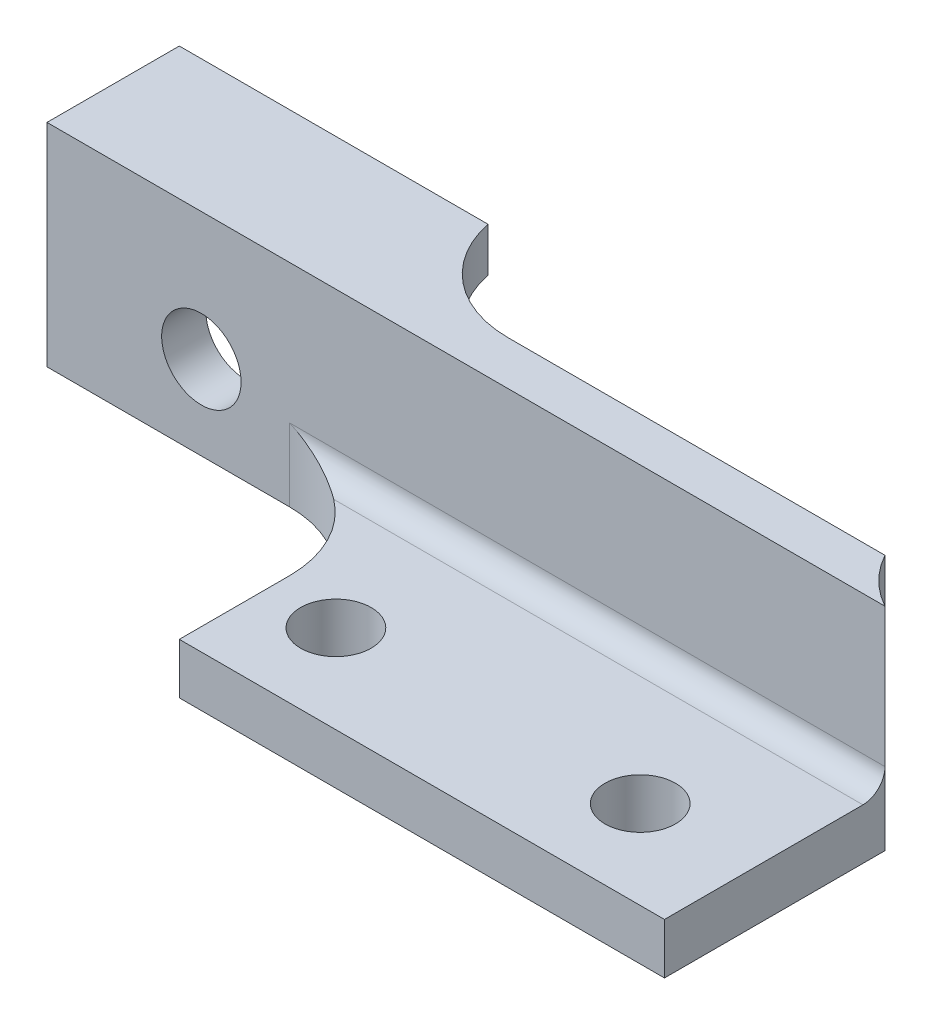
ISO-10303-21;
HEADER;
FILE_DESCRIPTION(('STEP AP214'),'2;1');
FILE_NAME('part.step','',(''),(''),'','','');
FILE_SCHEMA(('AUTOMOTIVE_DESIGN { 1 0 10303 214 1 1 1 1 }'));
ENDSEC;
DATA;
#1=APPLICATION_CONTEXT('core data for automotive mechanical design processes');
#2=APPLICATION_PROTOCOL_DEFINITION('international standard','automotive_design',2000,#1);
#3=PRODUCT_CONTEXT('',#1,'mechanical');
#4=PRODUCT('Part','Part','',(#3));
#5=PRODUCT_RELATED_PRODUCT_CATEGORY('part','',(#4));
#6=PRODUCT_DEFINITION_FORMATION('','',#4);
#7=PRODUCT_DEFINITION_CONTEXT('part definition',#1,'design');
#8=PRODUCT_DEFINITION('design','',#6,#7);
#9=PRODUCT_DEFINITION_SHAPE('','',#8);
#10=(LENGTH_UNIT() NAMED_UNIT(*) SI_UNIT(.MILLI.,.METRE.));
#11=(NAMED_UNIT(*) PLANE_ANGLE_UNIT() SI_UNIT($,.RADIAN.));
#12=(NAMED_UNIT(*) SI_UNIT($,.STERADIAN.) SOLID_ANGLE_UNIT());
#13=UNCERTAINTY_MEASURE_WITH_UNIT(LENGTH_MEASURE(1.E-05),#10,'distance_accuracy_value','');
#14=(GEOMETRIC_REPRESENTATION_CONTEXT(3) GLOBAL_UNCERTAINTY_ASSIGNED_CONTEXT((#13)) GLOBAL_UNIT_ASSIGNED_CONTEXT((#10,
#11,#12)) REPRESENTATION_CONTEXT('',''));
#15=CARTESIAN_POINT('',(0.,0.,0.));
#16=DIRECTION('',(0.,0.,1.));
#17=DIRECTION('',(1.,0.,0.));
#18=AXIS2_PLACEMENT_3D('',#15,#16,#17);
#19=CARTESIAN_POINT('',(-14.,0.,0.));
#20=DIRECTION('',(0.,0.,-1.));
#21=DIRECTION('',(-1.,0.,0.));
#22=AXIS2_PLACEMENT_3D('',#19,#20,#21);
#23=PLANE('',#22);
#24=CARTESIAN_POINT('',(-7.,0.,0.));
#25=DIRECTION('',(0.,0.,-1.));
#26=DIRECTION('',(-1.,0.,0.));
#27=AXIS2_PLACEMENT_3D('',#24,#25,#26);
#28=CIRCLE('',#27,1.8);
#29=CARTESIAN_POINT('',(-5.2,0.,0.));
#30=VERTEX_POINT('',#29);
#31=EDGE_CURVE('E156',#30,#30,#28,.F.);
#32=ORIENTED_EDGE('',*,*,#31,.T.);
#33=EDGE_LOOP('',(#32));
#34=FACE_BOUND('',#33,.T.);
#35=DIRECTION('',(1.,0.,0.));
#36=VECTOR('',#35,1.);
#37=CARTESIAN_POINT('',(-14.,3.8,0.));
#38=LINE('',#37,#36);
#39=CARTESIAN_POINT('',(-14.,3.8,0.));
#40=VERTEX_POINT('',#39);
#41=CARTESIAN_POINT('',(4.89897948556636,3.8,0.));
#42=VERTEX_POINT('',#41);
#43=EDGE_CURVE('E188',#40,#42,#38,.T.);
#44=ORIENTED_EDGE('',*,*,#43,.T.);
#45=DIRECTION('',(0.,-1.,0.));
#46=VECTOR('',#45,1.);
#47=CARTESIAN_POINT('',(4.89897948556636,5.8,0.));
#48=LINE('',#47,#46);
#49=CARTESIAN_POINT('',(4.89897948556636,5.8,0.));
#50=VERTEX_POINT('',#49);
#51=EDGE_CURVE('E193',#42,#50,#48,.F.);
#52=ORIENTED_EDGE('',*,*,#51,.T.);
#53=DIRECTION('',(-1.,0.,0.));
#54=VECTOR('',#53,1.);
#55=CARTESIAN_POINT('',(22.,5.8,0.));
#56=LINE('',#55,#54);
#57=CARTESIAN_POINT('',(22.,5.8,0.));
#58=VERTEX_POINT('',#57);
#59=EDGE_CURVE('E166',#58,#50,#56,.T.);
#60=ORIENTED_EDGE('',*,*,#59,.F.);
#61=DIRECTION('',(0.,1.,0.));
#62=VECTOR('',#61,1.);
#63=CARTESIAN_POINT('',(22.,0.,0.));
#64=LINE('',#63,#62);
#65=CARTESIAN_POINT('',(22.,-3.8,0.));
#66=VERTEX_POINT('',#65);
#67=EDGE_CURVE('E164',#66,#58,#64,.T.);
#68=ORIENTED_EDGE('',*,*,#67,.F.);
#69=DIRECTION('',(1.,0.,0.));
#70=VECTOR('',#69,1.);
#71=CARTESIAN_POINT('',(-14.,-3.8,0.));
#72=LINE('',#71,#70);
#73=CARTESIAN_POINT('',(-14.,-3.8,0.));
#74=VERTEX_POINT('',#73);
#75=EDGE_CURVE('E191',#74,#66,#72,.T.);
#76=ORIENTED_EDGE('',*,*,#75,.F.);
#77=DIRECTION('',(0.,1.,0.));
#78=VECTOR('',#77,1.);
#79=CARTESIAN_POINT('',(-14.,0.,0.));
#80=LINE('',#79,#78);
#81=EDGE_CURVE('E170',#74,#40,#80,.T.);
#82=ORIENTED_EDGE('',*,*,#81,.T.);
#83=EDGE_LOOP('',(#44,#52,#60,#68,#76,#82));
#84=FACE_BOUND('',#83,.T.);
#85=ADVANCED_FACE('F35',(#34,#84),#23,.T.);
#86=CARTESIAN_POINT('',(-14.,-3.8,0.));
#87=DIRECTION('',(0.,-1.,0.));
#88=DIRECTION('',(0.,0.,-1.));
#89=AXIS2_PLACEMENT_3D('',#86,#87,#88);
#90=PLANE('',#89);
#91=CARTESIAN_POINT('',(5.1,-3.8,8.));
#92=DIRECTION('',(0.,-1.,0.));
#93=DIRECTION('',(0.,0.,-1.));
#94=AXIS2_PLACEMENT_3D('',#91,#92,#93);
#95=CIRCLE('',#94,1.6);
#96=CARTESIAN_POINT('',(3.5,-3.8,8.));
#97=VERTEX_POINT('',#96);
#98=EDGE_CURVE('E302',#97,#97,#95,.F.);
#99=ORIENTED_EDGE('',*,*,#98,.T.);
#100=EDGE_LOOP('',(#99));
#101=FACE_BOUND('',#100,.T.);
#102=CARTESIAN_POINT('',(18.9,-3.8,8.));
#103=DIRECTION('',(0.,-1.,0.));
#104=DIRECTION('',(0.,0.,-1.));
#105=AXIS2_PLACEMENT_3D('',#102,#103,#104);
#106=CIRCLE('',#105,1.6);
#107=CARTESIAN_POINT('',(17.3,-3.8,8.));
#108=VERTEX_POINT('',#107);
#109=EDGE_CURVE('E306',#108,#108,#106,.F.);
#110=ORIENTED_EDGE('',*,*,#109,.T.);
#111=EDGE_LOOP('',(#110));
#112=FACE_BOUND('',#111,.T.);
#113=ORIENTED_EDGE('',*,*,#75,.T.);
#114=CARTESIAN_POINT('',(26.3911649915626,-3.8,-2.39116499156264));
#115=DIRECTION('',(0.,-1.,0.));
#116=DIRECTION('',(0.,0.,-1.));
#117=AXIS2_PLACEMENT_3D('',#114,#115,#116);
#118=CIRCLE('',#117,5.);
#119=CARTESIAN_POINT('',(24.,-3.8,2.));
#120=VERTEX_POINT('',#119);
#121=EDGE_CURVE('E216',#66,#120,#118,.F.);
#122=ORIENTED_EDGE('',*,*,#121,.T.);
#123=DIRECTION('',(0.,0.,-1.));
#124=VECTOR('',#123,1.);
#125=CARTESIAN_POINT('',(24.,-3.8,12.));
#126=LINE('',#125,#124);
#127=CARTESIAN_POINT('',(24.,-3.8,12.));
#128=VERTEX_POINT('',#127);
#129=EDGE_CURVE('E158',#128,#120,#126,.T.);
#130=ORIENTED_EDGE('',*,*,#129,.F.);
#131=DIRECTION('',(-1.,0.,0.));
#132=VECTOR('',#131,1.);
#133=CARTESIAN_POINT('',(0.,-3.8,12.));
#134=LINE('',#133,#132);
#135=CARTESIAN_POINT('',(2.,-3.8,12.));
#136=VERTEX_POINT('',#135);
#137=EDGE_CURVE('E141',#128,#136,#134,.T.);
#138=ORIENTED_EDGE('',*,*,#137,.T.);
#139=DIRECTION('',(0.,0.,-1.));
#140=VECTOR('',#139,1.);
#141=CARTESIAN_POINT('',(2.,-3.8,12.));
#142=LINE('',#141,#140);
#143=CARTESIAN_POINT('',(2.,-3.8,7.));
#144=VERTEX_POINT('',#143);
#145=EDGE_CURVE('E137',#136,#144,#142,.T.);
#146=ORIENTED_EDGE('',*,*,#145,.T.);
#147=CARTESIAN_POINT('',(-3.,-3.8,7.));
#148=DIRECTION('',(0.,-1.,0.));
#149=DIRECTION('',(0.,0.,-1.));
#150=AXIS2_PLACEMENT_3D('',#147,#148,#149);
#151=CIRCLE('',#150,5.);
#152=CARTESIAN_POINT('',(-3.,-3.8,2.));
#153=VERTEX_POINT('',#152);
#154=EDGE_CURVE('E228',#144,#153,#151,.F.);
#155=ORIENTED_EDGE('',*,*,#154,.T.);
#156=DIRECTION('',(1.,0.,0.));
#157=VECTOR('',#156,1.);
#158=CARTESIAN_POINT('',(-14.,-3.8,2.));
#159=LINE('',#158,#157);
#160=CARTESIAN_POINT('',(-14.,-3.8,2.));
#161=VERTEX_POINT('',#160);
#162=EDGE_CURVE('E194',#161,#153,#159,.T.);
#163=ORIENTED_EDGE('',*,*,#162,.F.);
#164=DIRECTION('',(0.,0.,-1.));
#165=VECTOR('',#164,1.);
#166=CARTESIAN_POINT('',(-14.,-3.8,0.));
#167=LINE('',#166,#165);
#168=EDGE_CURVE('E185',#161,#74,#167,.T.);
#169=ORIENTED_EDGE('',*,*,#168,.T.);
#170=EDGE_LOOP('',(#113,#122,#130,#138,#146,#155,#163,#169));
#171=FACE_BOUND('',#170,.T.);
#172=ADVANCED_FACE('F248',(#101,#112,#171),#90,.T.);
#173=CARTESIAN_POINT('',(-14.,0.,2.));
#174=DIRECTION('',(0.,0.,1.));
#175=DIRECTION('',(0.,-1.,0.));
#176=AXIS2_PLACEMENT_3D('',#173,#174,#175);
#177=PLANE('',#176);
#178=ORIENTED_EDGE('',*,*,#162,.T.);
#179=DIRECTION('',(0.,-1.,0.));
#180=VECTOR('',#179,1.);
#181=CARTESIAN_POINT('',(-3.,0.,2.));
#182=LINE('',#181,#180);
#183=CARTESIAN_POINT('',(-3.,-0.500000000000003,2.));
#184=VERTEX_POINT('',#183);
#185=EDGE_CURVE('E226',#153,#184,#182,.F.);
#186=ORIENTED_EDGE('',*,*,#185,.T.);
#187=DIRECTION('',(-1.,0.,0.));
#188=VECTOR('',#187,1.);
#189=CARTESIAN_POINT('',(-14.,-0.500000000000005,2.));
#190=LINE('',#189,#188);
#191=CARTESIAN_POINT('',(24.,-0.5,2.));
#192=VERTEX_POINT('',#191);
#193=EDGE_CURVE('E57',#184,#192,#190,.F.);
#194=ORIENTED_EDGE('',*,*,#193,.T.);
#195=DIRECTION('',(0.,1.,0.));
#196=VECTOR('',#195,1.);
#197=CARTESIAN_POINT('',(24.,0.,2.));
#198=LINE('',#197,#196);
#199=CARTESIAN_POINT('',(24.,5.8,2.));
#200=VERTEX_POINT('',#199);
#201=EDGE_CURVE('E218',#192,#200,#198,.T.);
#202=ORIENTED_EDGE('',*,*,#201,.T.);
#203=DIRECTION('',(1.,0.,0.));
#204=VECTOR('',#203,1.);
#205=CARTESIAN_POINT('',(-14.,5.8,2.));
#206=LINE('',#205,#204);
#207=CARTESIAN_POINT('',(-14.,5.8,2.));
#208=VERTEX_POINT('',#207);
#209=EDGE_CURVE('E197',#208,#200,#206,.T.);
#210=ORIENTED_EDGE('',*,*,#209,.F.);
#211=DIRECTION('',(0.,-1.,0.));
#212=VECTOR('',#211,1.);
#213=CARTESIAN_POINT('',(-14.,0.,2.));
#214=LINE('',#213,#212);
#215=EDGE_CURVE('E182',#208,#161,#214,.T.);
#216=ORIENTED_EDGE('',*,*,#215,.T.);
#217=EDGE_LOOP('',(#178,#186,#194,#202,#210,#216));
#218=FACE_BOUND('',#217,.T.);
#219=CARTESIAN_POINT('',(-7.,0.,2.));
#220=DIRECTION('',(0.,0.,1.));
#221=DIRECTION('',(1.,0.,0.));
#222=AXIS2_PLACEMENT_3D('',#219,#220,#221);
#223=CIRCLE('',#222,1.8);
#224=CARTESIAN_POINT('',(-5.2,0.,2.));
#225=VERTEX_POINT('',#224);
#226=EDGE_CURVE('E153',#225,#225,#223,.T.);
#227=ORIENTED_EDGE('',*,*,#226,.F.);
#228=EDGE_LOOP('',(#227));
#229=FACE_BOUND('',#228,.T.);
#230=ADVANCED_FACE('F262',(#218,#229),#177,.T.);
#231=CARTESIAN_POINT('',(-14.,5.8,0.));
#232=DIRECTION('',(0.,1.,0.));
#233=DIRECTION('',(0.,0.,1.));
#234=AXIS2_PLACEMENT_3D('',#231,#232,#233);
#235=PLANE('',#234);
#236=ORIENTED_EDGE('',*,*,#59,.T.);
#237=CARTESIAN_POINT('',(4.89897948556636,5.8,-5.));
#238=DIRECTION('',(0.,1.,0.));
#239=DIRECTION('',(0.,0.,1.));
#240=AXIS2_PLACEMENT_3D('',#237,#238,#239);
#241=CIRCLE('',#240,5.);
#242=CARTESIAN_POINT('',(0.,5.8,-4.));
#243=VERTEX_POINT('',#242);
#244=EDGE_CURVE('E208',#50,#243,#241,.F.);
#245=ORIENTED_EDGE('',*,*,#244,.T.);
#246=DIRECTION('',(1.,0.,0.));
#247=VECTOR('',#246,1.);
#248=CARTESIAN_POINT('',(-14.,5.8,-4.));
#249=LINE('',#248,#247);
#250=CARTESIAN_POINT('',(-14.,5.8,-4.));
#251=VERTEX_POINT('',#250);
#252=EDGE_CURVE('E200',#251,#243,#249,.T.);
#253=ORIENTED_EDGE('',*,*,#252,.F.);
#254=DIRECTION('',(0.,0.,1.));
#255=VECTOR('',#254,1.);
#256=CARTESIAN_POINT('',(-14.,5.8,0.));
#257=LINE('',#256,#255);
#258=EDGE_CURVE('E179',#251,#208,#257,.T.);
#259=ORIENTED_EDGE('',*,*,#258,.T.);
#260=ORIENTED_EDGE('',*,*,#209,.T.);
#261=CARTESIAN_POINT('',(26.3911649915626,5.8,-2.39116499156264));
#262=DIRECTION('',(0.,1.,0.));
#263=DIRECTION('',(0.,0.,1.));
#264=AXIS2_PLACEMENT_3D('',#261,#262,#263);
#265=CIRCLE('',#264,5.);
#266=EDGE_CURVE('E213',#200,#58,#265,.F.);
#267=ORIENTED_EDGE('',*,*,#266,.T.);
#268=EDGE_LOOP('',(#236,#245,#253,#259,#260,#267));
#269=FACE_BOUND('',#268,.T.);
#270=ADVANCED_FACE('F258',(#269),#235,.T.);
#271=CARTESIAN_POINT('',(-14.,0.,-4.));
#272=DIRECTION('',(0.,0.,-1.));
#273=DIRECTION('',(-1.,0.,0.));
#274=AXIS2_PLACEMENT_3D('',#271,#272,#273);
#275=PLANE('',#274);
#276=DIRECTION('',(0.,1.,0.));
#277=VECTOR('',#276,1.);
#278=CARTESIAN_POINT('',(0.,0.,-4.));
#279=LINE('',#278,#277);
#280=CARTESIAN_POINT('',(0.,3.8,-4.));
#281=VERTEX_POINT('',#280);
#282=EDGE_CURVE('E169',#281,#243,#279,.T.);
#283=ORIENTED_EDGE('',*,*,#282,.F.);
#284=DIRECTION('',(1.,0.,0.));
#285=VECTOR('',#284,1.);
#286=CARTESIAN_POINT('',(-14.,3.8,-4.));
#287=LINE('',#286,#285);
#288=CARTESIAN_POINT('',(-14.,3.8,-4.));
#289=VERTEX_POINT('',#288);
#290=EDGE_CURVE('E203',#289,#281,#287,.T.);
#291=ORIENTED_EDGE('',*,*,#290,.F.);
#292=DIRECTION('',(0.,1.,0.));
#293=VECTOR('',#292,1.);
#294=CARTESIAN_POINT('',(-14.,0.,-4.));
#295=LINE('',#294,#293);
#296=EDGE_CURVE('E176',#289,#251,#295,.T.);
#297=ORIENTED_EDGE('',*,*,#296,.T.);
#298=ORIENTED_EDGE('',*,*,#252,.T.);
#299=EDGE_LOOP('',(#283,#291,#297,#298));
#300=FACE_BOUND('',#299,.T.);
#301=ADVANCED_FACE('F254',(#300),#275,.T.);
#302=CARTESIAN_POINT('',(-14.,3.8,0.));
#303=DIRECTION('',(0.,-1.,0.));
#304=DIRECTION('',(0.,0.,-1.));
#305=AXIS2_PLACEMENT_3D('',#302,#303,#304);
#306=PLANE('',#305);
#307=ORIENTED_EDGE('',*,*,#290,.T.);
#308=CARTESIAN_POINT('',(4.89897948556636,3.8,-5.));
#309=DIRECTION('',(0.,-1.,0.));
#310=DIRECTION('',(0.,0.,-1.));
#311=AXIS2_PLACEMENT_3D('',#308,#309,#310);
#312=CIRCLE('',#311,5.);
#313=EDGE_CURVE('E210',#281,#42,#312,.F.);
#314=ORIENTED_EDGE('',*,*,#313,.T.);
#315=ORIENTED_EDGE('',*,*,#43,.F.);
#316=DIRECTION('',(0.,0.,-1.));
#317=VECTOR('',#316,1.);
#318=CARTESIAN_POINT('',(-14.,3.8,0.));
#319=LINE('',#318,#317);
#320=EDGE_CURVE('E173',#40,#289,#319,.T.);
#321=ORIENTED_EDGE('',*,*,#320,.T.);
#322=EDGE_LOOP('',(#307,#314,#315,#321));
#323=FACE_BOUND('',#322,.T.);
#324=ADVANCED_FACE('F250',(#323),#306,.T.);
#325=CARTESIAN_POINT('',(-14.,0.,0.));
#326=DIRECTION('',(1.,0.,0.));
#327=DIRECTION('',(0.,0.,-1.));
#328=AXIS2_PLACEMENT_3D('',#325,#326,#327);
#329=PLANE('',#328);
#330=ORIENTED_EDGE('',*,*,#81,.F.);
#331=ORIENTED_EDGE('',*,*,#168,.F.);
#332=ORIENTED_EDGE('',*,*,#215,.F.);
#333=ORIENTED_EDGE('',*,*,#258,.F.);
#334=ORIENTED_EDGE('',*,*,#296,.F.);
#335=ORIENTED_EDGE('',*,*,#320,.F.);
#336=EDGE_LOOP('',(#330,#331,#332,#333,#334,#335));
#337=FACE_BOUND('',#336,.T.);
#338=ADVANCED_FACE('F253',(#337),#329,.F.);
#339=CARTESIAN_POINT('',(-7.,0.,-5.09116882454314));
#340=DIRECTION('',(0.,0.,1.));
#341=DIRECTION('',(1.,0.,0.));
#342=AXIS2_PLACEMENT_3D('',#339,#340,#341);
#343=CYLINDRICAL_SURFACE('',#342,1.8);
#344=CARTESIAN_POINT('',(-5.2,0.,2.));
#345=CARTESIAN_POINT('',(-5.2,0.,1.97916666666667));
#346=CARTESIAN_POINT('',(-5.2,0.,1.95833333333333));
#347=CARTESIAN_POINT('',(-5.2,0.,1.91666666666667));
#348=CARTESIAN_POINT('',(-5.2,0.,1.89583333333333));
#349=CARTESIAN_POINT('',(-5.2,0.,1.85416666666667));
#350=CARTESIAN_POINT('',(-5.2,0.,1.83333333333333));
#351=CARTESIAN_POINT('',(-5.2,0.,1.79166666666667));
#352=CARTESIAN_POINT('',(-5.2,0.,1.77083333333333));
#353=CARTESIAN_POINT('',(-5.2,0.,1.72916666666667));
#354=CARTESIAN_POINT('',(-5.2,0.,1.70833333333333));
#355=CARTESIAN_POINT('',(-5.2,0.,1.66666666666667));
#356=CARTESIAN_POINT('',(-5.2,0.,1.64583333333333));
#357=CARTESIAN_POINT('',(-5.2,0.,1.60416666666667));
#358=CARTESIAN_POINT('',(-5.2,0.,1.58333333333333));
#359=CARTESIAN_POINT('',(-5.2,0.,1.54166666666667));
#360=CARTESIAN_POINT('',(-5.2,0.,1.52083333333333));
#361=CARTESIAN_POINT('',(-5.2,0.,1.47916666666667));
#362=CARTESIAN_POINT('',(-5.2,0.,1.45833333333333));
#363=CARTESIAN_POINT('',(-5.2,0.,1.41666666666667));
#364=CARTESIAN_POINT('',(-5.2,0.,1.39583333333333));
#365=CARTESIAN_POINT('',(-5.2,0.,1.35416666666667));
#366=CARTESIAN_POINT('',(-5.2,0.,1.33333333333333));
#367=CARTESIAN_POINT('',(-5.2,0.,1.29166666666667));
#368=CARTESIAN_POINT('',(-5.2,0.,1.27083333333333));
#369=CARTESIAN_POINT('',(-5.2,0.,1.22916666666667));
#370=CARTESIAN_POINT('',(-5.2,0.,1.20833333333333));
#371=CARTESIAN_POINT('',(-5.2,0.,1.16666666666667));
#372=CARTESIAN_POINT('',(-5.2,0.,1.14583333333333));
#373=CARTESIAN_POINT('',(-5.2,0.,1.10416666666667));
#374=CARTESIAN_POINT('',(-5.2,0.,1.08333333333333));
#375=CARTESIAN_POINT('',(-5.2,0.,1.04166666666667));
#376=CARTESIAN_POINT('',(-5.2,0.,1.02083333333333));
#377=CARTESIAN_POINT('',(-5.2,0.,0.979166666666668));
#378=CARTESIAN_POINT('',(-5.2,0.,0.958333333333334));
#379=CARTESIAN_POINT('',(-5.2,0.,0.916666666666668));
#380=CARTESIAN_POINT('',(-5.2,0.,0.895833333333334));
#381=CARTESIAN_POINT('',(-5.2,0.,0.854166666666667));
#382=CARTESIAN_POINT('',(-5.2,0.,0.833333333333334));
#383=CARTESIAN_POINT('',(-5.2,0.,0.791666666666667));
#384=CARTESIAN_POINT('',(-5.2,0.,0.770833333333334));
#385=CARTESIAN_POINT('',(-5.2,0.,0.729166666666667));
#386=CARTESIAN_POINT('',(-5.2,0.,0.708333333333334));
#387=CARTESIAN_POINT('',(-5.2,0.,0.666666666666668));
#388=CARTESIAN_POINT('',(-5.2,0.,0.645833333333334));
#389=CARTESIAN_POINT('',(-5.2,0.,0.604166666666668));
#390=CARTESIAN_POINT('',(-5.2,0.,0.583333333333335));
#391=CARTESIAN_POINT('',(-5.2,0.,0.541666666666668));
#392=CARTESIAN_POINT('',(-5.2,0.,0.520833333333335));
#393=CARTESIAN_POINT('',(-5.2,0.,0.479166666666668));
#394=CARTESIAN_POINT('',(-5.2,0.,0.458333333333335));
#395=CARTESIAN_POINT('',(-5.2,0.,0.416666666666668));
#396=CARTESIAN_POINT('',(-5.2,0.,0.395833333333335));
#397=CARTESIAN_POINT('',(-5.2,0.,0.354166666666668));
#398=CARTESIAN_POINT('',(-5.2,0.,0.333333333333335));
#399=CARTESIAN_POINT('',(-5.2,0.,0.291666666666668));
#400=CARTESIAN_POINT('',(-5.2,0.,0.270833333333334));
#401=CARTESIAN_POINT('',(-5.2,0.,0.229166666666668));
#402=CARTESIAN_POINT('',(-5.2,0.,0.208333333333334));
#403=CARTESIAN_POINT('',(-5.2,0.,0.166666666666668));
#404=CARTESIAN_POINT('',(-5.2,0.,0.145833333333334));
#405=CARTESIAN_POINT('',(-5.2,0.,0.104166666666668));
#406=CARTESIAN_POINT('',(-5.2,0.,0.0833333333333343));
#407=CARTESIAN_POINT('',(-5.2,0.,0.0416666666666676));
#408=CARTESIAN_POINT('',(-5.2,0.,0.0208333333333342));
#409=CARTESIAN_POINT('',(-5.2,0.,0.));
#410=B_SPLINE_CURVE_WITH_KNOTS('',3,(#344,#345,#346,#347,#348,#349,#350,#351,#352,#353,#354,
#355,#356,#357,#358,#359,#360,#361,#362,#363,#364,#365,#366,#367,#368,#369,#370,#371,#372,#373,
#374,#375,#376,#377,#378,#379,#380,#381,#382,#383,#384,#385,#386,#387,#388,#389,#390,#391,#392,
#393,#394,#395,#396,#397,#398,#399,#400,#401,#402,#403,#404,#405,#406,#407,#408,#409),
.UNSPECIFIED.,.F.,.F.,(4,2,2,2,2,2,2,2,2,2,2,2,2,2,2,2,2,2,2,2,2,2,2,2,2,2,2,2,2,2,2,2,4),(0.,
0.0625000000000001,0.125,0.1875,0.25,0.3125,0.375,0.4375,0.5,0.5625,0.625,0.6875,0.75,0.8125,
0.875,0.9375,1.,1.0625,1.125,1.1875,1.25,1.3125,1.375,1.4375,1.5,1.5625,1.625,1.6875,1.75,
1.8125,1.875,1.9375,2.),.UNSPECIFIED.);
#411=EDGE_CURVE('BSEAM272',#225,#30,#410,.T.);
#412=ORIENTED_EDGE('',*,*,#226,.T.);
#413=ORIENTED_EDGE('',*,*,#31,.F.);
#414=ORIENTED_EDGE('',*,*,#411,.T.);
#415=ORIENTED_EDGE('',*,*,#411,.F.);
#416=EDGE_LOOP('',(#412,#414,#413,#415));
#417=FACE_BOUND('',#416,.T.);
#418=ADVANCED_FACE('F272',(#417),#343,.F.);
#419=CARTESIAN_POINT('',(0.,-1.5,12.));
#420=DIRECTION('',(0.,-1.,0.));
#421=DIRECTION('',(1.,0.,0.));
#422=AXIS2_PLACEMENT_3D('',#419,#420,#421);
#423=PLANE('',#422);
#424=CARTESIAN_POINT('',(5.1,-1.5,8.));
#425=DIRECTION('',(0.,1.,0.));
#426=DIRECTION('',(-1.,0.,0.));
#427=AXIS2_PLACEMENT_3D('',#424,#425,#426);
#428=CIRCLE('',#427,1.6);
#429=CARTESIAN_POINT('',(3.5,-1.5,8.));
#430=VERTEX_POINT('',#429);
#431=EDGE_CURVE('E299',#430,#430,#428,.T.);
#432=ORIENTED_EDGE('',*,*,#431,.F.);
#433=EDGE_LOOP('',(#432));
#434=FACE_BOUND('',#433,.T.);
#435=CARTESIAN_POINT('',(18.9,-1.5,8.));
#436=DIRECTION('',(0.,1.,0.));
#437=DIRECTION('',(-1.,0.,0.));
#438=AXIS2_PLACEMENT_3D('',#435,#436,#437);
#439=CIRCLE('',#438,1.6);
#440=CARTESIAN_POINT('',(17.3,-1.5,8.));
#441=VERTEX_POINT('',#440);
#442=EDGE_CURVE('E309',#441,#441,#439,.T.);
#443=ORIENTED_EDGE('',*,*,#442,.F.);
#444=EDGE_LOOP('',(#443));
#445=FACE_BOUND('',#444,.T.);
#446=DIRECTION('',(0.,0.,-1.));
#447=VECTOR('',#446,1.);
#448=CARTESIAN_POINT('',(24.,-1.5,12.));
#449=LINE('',#448,#447);
#450=CARTESIAN_POINT('',(24.,-1.5,12.));
#451=VERTEX_POINT('',#450);
#452=CARTESIAN_POINT('',(24.,-1.5,3.));
#453=VERTEX_POINT('',#452);
#454=EDGE_CURVE('E315',#451,#453,#449,.T.);
#455=ORIENTED_EDGE('',*,*,#454,.T.);
#456=DIRECTION('',(-1.,0.,0.));
#457=VECTOR('',#456,1.);
#458=CARTESIAN_POINT('',(0.,-1.5,3.));
#459=LINE('',#458,#457);
#460=CARTESIAN_POINT('',(0.,-1.5,3.));
#461=VERTEX_POINT('',#460);
#462=EDGE_CURVE('E50',#453,#461,#459,.T.);
#463=ORIENTED_EDGE('',*,*,#462,.T.);
#464=CARTESIAN_POINT('',(-3.,-1.5,7.));
#465=DIRECTION('',(0.,-1.,0.));
#466=DIRECTION('',(1.,0.,0.));
#467=AXIS2_PLACEMENT_3D('',#464,#465,#466);
#468=CIRCLE('',#467,5.);
#469=CARTESIAN_POINT('',(2.,-1.5,7.));
#470=VERTEX_POINT('',#469);
#471=EDGE_CURVE('E11',#461,#470,#468,.T.);
#472=ORIENTED_EDGE('',*,*,#471,.T.);
#473=DIRECTION('',(0.,0.,-1.));
#474=VECTOR('',#473,1.);
#475=CARTESIAN_POINT('',(2.,-1.5,12.));
#476=LINE('',#475,#474);
#477=CARTESIAN_POINT('',(2.,-1.5,12.));
#478=VERTEX_POINT('',#477);
#479=EDGE_CURVE('E134',#478,#470,#476,.T.);
#480=ORIENTED_EDGE('',*,*,#479,.F.);
#481=DIRECTION('',(-1.,0.,0.));
#482=VECTOR('',#481,1.);
#483=CARTESIAN_POINT('',(0.,-1.5,12.));
#484=LINE('',#483,#482);
#485=EDGE_CURVE('E142',#451,#478,#484,.T.);
#486=ORIENTED_EDGE('',*,*,#485,.F.);
#487=EDGE_LOOP('',(#455,#463,#472,#480,#486));
#488=FACE_BOUND('',#487,.T.);
#489=ADVANCED_FACE('F151',(#434,#445,#488),#423,.F.);
#490=CARTESIAN_POINT('',(2.,0.,12.));
#491=DIRECTION('',(1.,0.,0.));
#492=DIRECTION('',(0.,1.,0.));
#493=AXIS2_PLACEMENT_3D('',#490,#491,#492);
#494=PLANE('',#493);
#495=ORIENTED_EDGE('',*,*,#479,.T.);
#496=DIRECTION('',(0.,-1.,0.));
#497=VECTOR('',#496,1.);
#498=CARTESIAN_POINT('',(2.,0.,7.));
#499=LINE('',#498,#497);
#500=EDGE_CURVE('E224',#470,#144,#499,.T.);
#501=ORIENTED_EDGE('',*,*,#500,.T.);
#502=ORIENTED_EDGE('',*,*,#145,.F.);
#503=DIRECTION('',(0.,-1.,0.));
#504=VECTOR('',#503,1.);
#505=CARTESIAN_POINT('',(2.,0.,12.));
#506=LINE('',#505,#504);
#507=EDGE_CURVE('E129',#478,#136,#506,.T.);
#508=ORIENTED_EDGE('',*,*,#507,.F.);
#509=EDGE_LOOP('',(#495,#501,#502,#508));
#510=FACE_BOUND('',#509,.T.);
#511=ADVANCED_FACE('F131',(#510),#494,.F.);
#512=CARTESIAN_POINT('',(24.,0.,12.));
#513=DIRECTION('',(1.,0.,0.));
#514=DIRECTION('',(0.,0.,-1.));
#515=AXIS2_PLACEMENT_3D('',#512,#513,#514);
#516=PLANE('',#515);
#517=DIRECTION('',(0.,-1.,0.));
#518=VECTOR('',#517,1.);
#519=CARTESIAN_POINT('',(24.,0.,2.));
#520=LINE('',#519,#518);
#521=EDGE_CURVE('E149',#192,#120,#520,.T.);
#522=ORIENTED_EDGE('',*,*,#521,.F.);
#523=CARTESIAN_POINT('',(24.,-0.5,3.));
#524=DIRECTION('',(1.,0.,0.));
#525=DIRECTION('',(0.,0.,-1.));
#526=AXIS2_PLACEMENT_3D('',#523,#524,#525);
#527=CIRCLE('',#526,1.);
#528=EDGE_CURVE('E222',#192,#453,#527,.F.);
#529=ORIENTED_EDGE('',*,*,#528,.T.);
#530=ORIENTED_EDGE('',*,*,#454,.F.);
#531=DIRECTION('',(0.,-1.,0.));
#532=VECTOR('',#531,1.);
#533=CARTESIAN_POINT('',(24.,0.,12.));
#534=LINE('',#533,#532);
#535=EDGE_CURVE('E148',#451,#128,#534,.T.);
#536=ORIENTED_EDGE('',*,*,#535,.T.);
#537=ORIENTED_EDGE('',*,*,#129,.T.);
#538=EDGE_LOOP('',(#522,#529,#530,#536,#537));
#539=FACE_BOUND('',#538,.T.);
#540=ADVANCED_FACE('F282',(#539),#516,.T.);
#541=CARTESIAN_POINT('',(0.,0.,12.));
#542=DIRECTION('',(0.,0.,1.));
#543=DIRECTION('',(1.,0.,0.));
#544=AXIS2_PLACEMENT_3D('',#541,#542,#543);
#545=PLANE('',#544);
#546=ORIENTED_EDGE('',*,*,#485,.T.);
#547=ORIENTED_EDGE('',*,*,#507,.T.);
#548=ORIENTED_EDGE('',*,*,#137,.F.);
#549=ORIENTED_EDGE('',*,*,#535,.F.);
#550=EDGE_LOOP('',(#546,#547,#548,#549));
#551=FACE_BOUND('',#550,.T.);
#552=ADVANCED_FACE('F146',(#551),#545,.T.);
#553=CARTESIAN_POINT('',(18.9,-8.32548339959391,8.));
#554=DIRECTION('',(0.,1.,0.));
#555=DIRECTION('',(-1.,0.,0.));
#556=AXIS2_PLACEMENT_3D('',#553,#554,#555);
#557=CYLINDRICAL_SURFACE('',#556,1.6);
#558=CARTESIAN_POINT('',(17.3,-1.5,8.));
#559=CARTESIAN_POINT('',(17.3,-1.52395833333333,8.));
#560=CARTESIAN_POINT('',(17.3,-1.54791666666667,8.));
#561=CARTESIAN_POINT('',(17.3,-1.59583333333333,8.));
#562=CARTESIAN_POINT('',(17.3,-1.61979166666667,8.));
#563=CARTESIAN_POINT('',(17.3,-1.66770833333333,8.));
#564=CARTESIAN_POINT('',(17.3,-1.69166666666667,8.));
#565=CARTESIAN_POINT('',(17.3,-1.73958333333333,8.));
#566=CARTESIAN_POINT('',(17.3,-1.76354166666667,8.));
#567=CARTESIAN_POINT('',(17.3,-1.81145833333333,8.));
#568=CARTESIAN_POINT('',(17.3,-1.83541666666667,8.));
#569=CARTESIAN_POINT('',(17.3,-1.88333333333333,8.));
#570=CARTESIAN_POINT('',(17.3,-1.90729166666667,8.));
#571=CARTESIAN_POINT('',(17.3,-1.95520833333333,8.));
#572=CARTESIAN_POINT('',(17.3,-1.97916666666667,8.));
#573=CARTESIAN_POINT('',(17.3,-2.02708333333333,8.));
#574=CARTESIAN_POINT('',(17.3,-2.05104166666667,8.));
#575=CARTESIAN_POINT('',(17.3,-2.09895833333333,8.));
#576=CARTESIAN_POINT('',(17.3,-2.12291666666667,8.));
#577=CARTESIAN_POINT('',(17.3,-2.17083333333333,8.));
#578=CARTESIAN_POINT('',(17.3,-2.19479166666667,8.));
#579=CARTESIAN_POINT('',(17.3,-2.24270833333333,8.));
#580=CARTESIAN_POINT('',(17.3,-2.26666666666667,8.));
#581=CARTESIAN_POINT('',(17.3,-2.31458333333333,8.));
#582=CARTESIAN_POINT('',(17.3,-2.33854166666667,8.));
#583=CARTESIAN_POINT('',(17.3,-2.38645833333333,8.));
#584=CARTESIAN_POINT('',(17.3,-2.41041666666667,8.));
#585=CARTESIAN_POINT('',(17.3,-2.45833333333333,8.));
#586=CARTESIAN_POINT('',(17.3,-2.48229166666667,8.));
#587=CARTESIAN_POINT('',(17.3,-2.53020833333333,8.));
#588=CARTESIAN_POINT('',(17.3,-2.55416666666667,8.));
#589=CARTESIAN_POINT('',(17.3,-2.60208333333333,8.));
#590=CARTESIAN_POINT('',(17.3,-2.62604166666667,8.));
#591=CARTESIAN_POINT('',(17.3,-2.67395833333333,8.));
#592=CARTESIAN_POINT('',(17.3,-2.69791666666667,8.));
#593=CARTESIAN_POINT('',(17.3,-2.74583333333333,8.));
#594=CARTESIAN_POINT('',(17.3,-2.76979166666667,8.));
#595=CARTESIAN_POINT('',(17.3,-2.81770833333333,8.));
#596=CARTESIAN_POINT('',(17.3,-2.84166666666667,8.));
#597=CARTESIAN_POINT('',(17.3,-2.88958333333333,8.));
#598=CARTESIAN_POINT('',(17.3,-2.91354166666667,8.));
#599=CARTESIAN_POINT('',(17.3,-2.96145833333333,8.));
#600=CARTESIAN_POINT('',(17.3,-2.98541666666667,8.));
#601=CARTESIAN_POINT('',(17.3,-3.03333333333333,8.));
#602=CARTESIAN_POINT('',(17.3,-3.05729166666667,8.));
#603=CARTESIAN_POINT('',(17.3,-3.10520833333333,8.));
#604=CARTESIAN_POINT('',(17.3,-3.12916666666667,8.));
#605=CARTESIAN_POINT('',(17.3,-3.17708333333333,8.));
#606=CARTESIAN_POINT('',(17.3,-3.20104166666667,8.));
#607=CARTESIAN_POINT('',(17.3,-3.24895833333333,8.));
#608=CARTESIAN_POINT('',(17.3,-3.27291666666667,8.));
#609=CARTESIAN_POINT('',(17.3,-3.32083333333333,8.));
#610=CARTESIAN_POINT('',(17.3,-3.34479166666667,8.));
#611=CARTESIAN_POINT('',(17.3,-3.39270833333333,8.));
#612=CARTESIAN_POINT('',(17.3,-3.41666666666667,8.));
#613=CARTESIAN_POINT('',(17.3,-3.46458333333333,8.));
#614=CARTESIAN_POINT('',(17.3,-3.48854166666667,8.));
#615=CARTESIAN_POINT('',(17.3,-3.53645833333333,8.));
#616=CARTESIAN_POINT('',(17.3,-3.56041666666667,8.));
#617=CARTESIAN_POINT('',(17.3,-3.60833333333333,8.));
#618=CARTESIAN_POINT('',(17.3,-3.63229166666667,8.));
#619=CARTESIAN_POINT('',(17.3,-3.68020833333333,8.));
#620=CARTESIAN_POINT('',(17.3,-3.70416666666667,8.));
#621=CARTESIAN_POINT('',(17.3,-3.75208333333333,8.));
#622=CARTESIAN_POINT('',(17.3,-3.77604166666667,8.));
#623=CARTESIAN_POINT('',(17.3,-3.8,8.));
#624=B_SPLINE_CURVE_WITH_KNOTS('',3,(#558,#559,#560,#561,#562,#563,#564,#565,#566,#567,#568,
#569,#570,#571,#572,#573,#574,#575,#576,#577,#578,#579,#580,#581,#582,#583,#584,#585,#586,#587,
#588,#589,#590,#591,#592,#593,#594,#595,#596,#597,#598,#599,#600,#601,#602,#603,#604,#605,#606,
#607,#608,#609,#610,#611,#612,#613,#614,#615,#616,#617,#618,#619,#620,#621,#622,#623),
.UNSPECIFIED.,.F.,.F.,(4,2,2,2,2,2,2,2,2,2,2,2,2,2,2,2,2,2,2,2,2,2,2,2,2,2,2,2,2,2,2,2,4),(0.,
0.0718749999999999,0.14375,0.215625,0.2875,0.359375,0.43125,0.503125,0.575,0.646875,0.71875,
0.790625,0.8625,0.934375,1.00625,1.078125,1.15,1.221875,1.29375,1.365625,1.4375,1.509375,
1.58125,1.653125,1.725,1.796875,1.86875,1.940625,2.0125,2.084375,2.15625,2.228125,2.3),.UNSPECIFIED.);
#625=EDGE_CURVE('BSEAM288',#441,#108,#624,.T.);
#626=ORIENTED_EDGE('',*,*,#442,.T.);
#627=ORIENTED_EDGE('',*,*,#109,.F.);
#628=ORIENTED_EDGE('',*,*,#625,.T.);
#629=ORIENTED_EDGE('',*,*,#625,.F.);
#630=EDGE_LOOP('',(#626,#628,#627,#629));
#631=FACE_BOUND('',#630,.T.);
#632=ADVANCED_FACE('F288',(#631),#557,.F.);
#633=CARTESIAN_POINT('',(5.1,-8.32548339959391,8.));
#634=DIRECTION('',(0.,1.,0.));
#635=DIRECTION('',(-1.,0.,0.));
#636=AXIS2_PLACEMENT_3D('',#633,#634,#635);
#637=CYLINDRICAL_SURFACE('',#636,1.6);
#638=CARTESIAN_POINT('',(3.5,-1.5,8.));
#639=CARTESIAN_POINT('',(3.5,-1.52395833333334,8.));
#640=CARTESIAN_POINT('',(3.5,-1.54791666666667,8.));
#641=CARTESIAN_POINT('',(3.5,-1.59583333333334,8.));
#642=CARTESIAN_POINT('',(3.5,-1.61979166666667,8.));
#643=CARTESIAN_POINT('',(3.5,-1.66770833333334,8.));
#644=CARTESIAN_POINT('',(3.5,-1.69166666666667,8.));
#645=CARTESIAN_POINT('',(3.5,-1.73958333333334,8.));
#646=CARTESIAN_POINT('',(3.5,-1.76354166666667,8.));
#647=CARTESIAN_POINT('',(3.5,-1.81145833333334,8.));
#648=CARTESIAN_POINT('',(3.5,-1.83541666666667,8.));
#649=CARTESIAN_POINT('',(3.5,-1.88333333333333,8.));
#650=CARTESIAN_POINT('',(3.5,-1.90729166666667,8.));
#651=CARTESIAN_POINT('',(3.5,-1.95520833333334,8.));
#652=CARTESIAN_POINT('',(3.5,-1.97916666666667,8.));
#653=CARTESIAN_POINT('',(3.5,-2.02708333333334,8.));
#654=CARTESIAN_POINT('',(3.5,-2.05104166666667,8.));
#655=CARTESIAN_POINT('',(3.5,-2.09895833333334,8.));
#656=CARTESIAN_POINT('',(3.5,-2.12291666666667,8.));
#657=CARTESIAN_POINT('',(3.5,-2.17083333333334,8.));
#658=CARTESIAN_POINT('',(3.5,-2.19479166666667,8.));
#659=CARTESIAN_POINT('',(3.5,-2.24270833333334,8.));
#660=CARTESIAN_POINT('',(3.5,-2.26666666666667,8.));
#661=CARTESIAN_POINT('',(3.5,-2.31458333333333,8.));
#662=CARTESIAN_POINT('',(3.5,-2.33854166666667,8.));
#663=CARTESIAN_POINT('',(3.5,-2.38645833333333,8.));
#664=CARTESIAN_POINT('',(3.5,-2.41041666666667,8.));
#665=CARTESIAN_POINT('',(3.5,-2.45833333333333,8.));
#666=CARTESIAN_POINT('',(3.5,-2.48229166666667,8.));
#667=CARTESIAN_POINT('',(3.5,-2.53020833333333,8.));
#668=CARTESIAN_POINT('',(3.5,-2.55416666666667,8.));
#669=CARTESIAN_POINT('',(3.5,-2.60208333333333,8.));
#670=CARTESIAN_POINT('',(3.5,-2.62604166666667,8.));
#671=CARTESIAN_POINT('',(3.5,-2.67395833333333,8.));
#672=CARTESIAN_POINT('',(3.5,-2.69791666666667,8.));
#673=CARTESIAN_POINT('',(3.5,-2.74583333333333,8.));
#674=CARTESIAN_POINT('',(3.5,-2.76979166666667,8.));
#675=CARTESIAN_POINT('',(3.5,-2.81770833333333,8.));
#676=CARTESIAN_POINT('',(3.5,-2.84166666666667,8.));
#677=CARTESIAN_POINT('',(3.5,-2.88958333333333,8.));
#678=CARTESIAN_POINT('',(3.5,-2.91354166666667,8.));
#679=CARTESIAN_POINT('',(3.5,-2.96145833333333,8.));
#680=CARTESIAN_POINT('',(3.5,-2.98541666666667,8.));
#681=CARTESIAN_POINT('',(3.5,-3.03333333333333,8.));
#682=CARTESIAN_POINT('',(3.5,-3.05729166666667,8.));
#683=CARTESIAN_POINT('',(3.5,-3.10520833333333,8.));
#684=CARTESIAN_POINT('',(3.5,-3.12916666666667,8.));
#685=CARTESIAN_POINT('',(3.5,-3.17708333333333,8.));
#686=CARTESIAN_POINT('',(3.5,-3.20104166666667,8.));
#687=CARTESIAN_POINT('',(3.5,-3.24895833333333,8.));
#688=CARTESIAN_POINT('',(3.5,-3.27291666666667,8.));
#689=CARTESIAN_POINT('',(3.5,-3.32083333333333,8.));
#690=CARTESIAN_POINT('',(3.5,-3.34479166666667,8.));
#691=CARTESIAN_POINT('',(3.5,-3.39270833333333,8.));
#692=CARTESIAN_POINT('',(3.5,-3.41666666666667,8.));
#693=CARTESIAN_POINT('',(3.5,-3.46458333333333,8.));
#694=CARTESIAN_POINT('',(3.5,-3.48854166666667,8.));
#695=CARTESIAN_POINT('',(3.5,-3.53645833333333,8.));
#696=CARTESIAN_POINT('',(3.5,-3.56041666666667,8.));
#697=CARTESIAN_POINT('',(3.5,-3.60833333333333,8.));
#698=CARTESIAN_POINT('',(3.5,-3.63229166666667,8.));
#699=CARTESIAN_POINT('',(3.5,-3.68020833333333,8.));
#700=CARTESIAN_POINT('',(3.5,-3.70416666666667,8.));
#701=CARTESIAN_POINT('',(3.5,-3.75208333333333,8.));
#702=CARTESIAN_POINT('',(3.5,-3.77604166666667,8.));
#703=CARTESIAN_POINT('',(3.5,-3.8,8.));
#704=B_SPLINE_CURVE_WITH_KNOTS('',3,(#638,#639,#640,#641,#642,#643,#644,#645,#646,#647,#648,
#649,#650,#651,#652,#653,#654,#655,#656,#657,#658,#659,#660,#661,#662,#663,#664,#665,#666,#667,
#668,#669,#670,#671,#672,#673,#674,#675,#676,#677,#678,#679,#680,#681,#682,#683,#684,#685,#686,
#687,#688,#689,#690,#691,#692,#693,#694,#695,#696,#697,#698,#699,#700,#701,#702,#703),
.UNSPECIFIED.,.F.,.F.,(4,2,2,2,2,2,2,2,2,2,2,2,2,2,2,2,2,2,2,2,2,2,2,2,2,2,2,2,2,2,2,2,4),(0.,
0.0718749999999999,0.14375,0.215625,0.2875,0.359374999999999,0.431249999999999,0.503125,
0.574999999999999,0.646875,0.71875,0.790625,0.8625,0.934374999999999,1.00625,1.078125,1.15,
1.221875,1.29375,1.365625,1.4375,1.509375,1.58125,1.653125,1.725,1.796875,1.86875,1.940625,
2.0125,2.084375,2.15625,2.228125,2.3),.UNSPECIFIED.);
#705=EDGE_CURVE('BSEAM244',#430,#97,#704,.T.);
#706=ORIENTED_EDGE('',*,*,#431,.T.);
#707=ORIENTED_EDGE('',*,*,#98,.F.);
#708=ORIENTED_EDGE('',*,*,#705,.T.);
#709=ORIENTED_EDGE('',*,*,#705,.F.);
#710=EDGE_LOOP('',(#706,#708,#707,#709));
#711=FACE_BOUND('',#710,.T.);
#712=ADVANCED_FACE('F244',(#711),#637,.F.);
#713=CARTESIAN_POINT('',(4.89897948556636,0.,-5.));
#714=DIRECTION('',(0.,1.,0.));
#715=DIRECTION('',(0.,0.,1.));
#716=AXIS2_PLACEMENT_3D('',#713,#714,#715);
#717=CYLINDRICAL_SURFACE('',#716,5.);
#718=ORIENTED_EDGE('',*,*,#313,.F.);
#719=ORIENTED_EDGE('',*,*,#282,.T.);
#720=ORIENTED_EDGE('',*,*,#244,.F.);
#721=ORIENTED_EDGE('',*,*,#51,.F.);
#722=EDGE_LOOP('',(#718,#719,#720,#721));
#723=FACE_BOUND('',#722,.T.);
#724=ADVANCED_FACE('F240',(#723),#717,.F.);
#725=CARTESIAN_POINT('',(26.3911649915626,0.,-2.39116499156264));
#726=DIRECTION('',(0.,1.,0.));
#727=DIRECTION('',(0.,0.,1.));
#728=AXIS2_PLACEMENT_3D('',#725,#726,#727);
#729=CYLINDRICAL_SURFACE('',#728,5.);
#730=ORIENTED_EDGE('',*,*,#201,.F.);
#731=ORIENTED_EDGE('',*,*,#521,.T.);
#732=ORIENTED_EDGE('',*,*,#121,.F.);
#733=ORIENTED_EDGE('',*,*,#67,.T.);
#734=ORIENTED_EDGE('',*,*,#266,.F.);
#735=EDGE_LOOP('',(#730,#731,#732,#733,#734));
#736=FACE_BOUND('',#735,.T.);
#737=ADVANCED_FACE('F237',(#736),#729,.F.);
#738=CARTESIAN_POINT('',(0.,-0.500000000000003,3.));
#739=DIRECTION('',(-1.,0.,0.));
#740=DIRECTION('',(0.,-1.,0.));
#741=AXIS2_PLACEMENT_3D('',#738,#739,#740);
#742=CYLINDRICAL_SURFACE('',#741,1.);
#743=ORIENTED_EDGE('',*,*,#528,.F.);
#744=ORIENTED_EDGE('',*,*,#193,.F.);
#745=CARTESIAN_POINT('',(0.,-1.5,3.));
#746=CARTESIAN_POINT('',(-0.0630553046935,-1.49996283766289,2.95269543909306));
#747=CARTESIAN_POINT('',(-0.127174716792422,-1.4966475188885,2.90694840116783));
#748=CARTESIAN_POINT('',(-0.257017724288386,-1.4844642159685,2.81883226441321));
#749=CARTESIAN_POINT('',(-0.322738038153087,-1.47560680021902,2.77645690898266));
#750=CARTESIAN_POINT('',(-0.455052294593879,-1.45341063181509,2.69544093852616));
#751=CARTESIAN_POINT('',(-0.521637312671844,-1.44010261823866,2.65677698529484));
#752=CARTESIAN_POINT('',(-0.655885692977983,-1.40972691765819,2.58287395537811));
#753=CARTESIAN_POINT('',(-0.723549736591413,-1.3926567600438,2.54763715133025));
#754=CARTESIAN_POINT('',(-0.90307007713465,-1.34353105342674,2.45926114729799));
#755=CARTESIAN_POINT('',(-1.01563736153795,-1.30885369715323,2.40900552682413));
#756=CARTESIAN_POINT('',(-1.24234446212425,-1.23330930529322,2.31752155415558));
#757=CARTESIAN_POINT('',(-1.3564849250171,-1.1924396507108,2.27629703974416));
#758=CARTESIAN_POINT('',(-1.58630511986248,-1.1059885385923,2.20249150919588));
#759=CARTESIAN_POINT('',(-1.70198911017203,-1.06038938552017,2.16994470961468));
#760=CARTESIAN_POINT('',(-1.93407206504282,-0.9659520382432,2.11348216845219));
#761=CARTESIAN_POINT('',(-2.05047078725849,-0.917114892272727,2.08956364963487));
#762=CARTESIAN_POINT('',(-2.30347619427196,-0.808846433204601,2.0468208653339));
#763=CARTESIAN_POINT('',(-2.44017388775034,-0.74901944257499,2.02954044031088));
#764=CARTESIAN_POINT('',(-2.71362704128055,-0.628050078867547,2.00632651981242));
#765=CARTESIAN_POINT('',(-2.85038179276514,-0.566910693132537,2.00036955146972));
#766=CARTESIAN_POINT('',(-2.99139341388571,-0.503848981460461,2.00000555844377));
#767=CARTESIAN_POINT('',(-2.99569673335852,-0.501924478426037,2.00000000322476));
#768=CARTESIAN_POINT('',(-3.,-0.500000000000003,2.));
#769=B_SPLINE_CURVE_WITH_KNOTS('',3,(#745,#746,#747,#748,#749,#750,#751,#752,#753,#754,#755,
#756,#757,#758,#759,#760,#761,#762,#763,#764,#765,#766,#767,#768),.UNSPECIFIED.,.F.,.F.,(4,2,2,
2,2,2,2,2,2,2,2,4),(0.,0.23627220085103,0.472095214354499,0.706321989678131,0.940703043144744,
1.32429275355721,1.70804515619832,2.09328905143221,2.47840883504634,2.92860728181179,
3.37787147131307,3.39201361675779),.UNSPECIFIED.);
#770=EDGE_CURVE('E44',#184,#461,#769,.F.);
#771=ORIENTED_EDGE('',*,*,#770,.T.);
#772=ORIENTED_EDGE('',*,*,#462,.F.);
#773=EDGE_LOOP('',(#743,#744,#771,#772));
#774=FACE_BOUND('',#773,.T.);
#775=ADVANCED_FACE('F233',(#774),#742,.F.);
#776=CARTESIAN_POINT('',(-3.,0.,7.));
#777=DIRECTION('',(0.,-1.,0.));
#778=DIRECTION('',(1.,0.,0.));
#779=AXIS2_PLACEMENT_3D('',#776,#777,#778);
#780=CYLINDRICAL_SURFACE('',#779,5.);
#781=ORIENTED_EDGE('',*,*,#770,.F.);
#782=ORIENTED_EDGE('',*,*,#185,.F.);
#783=ORIENTED_EDGE('',*,*,#154,.F.);
#784=ORIENTED_EDGE('',*,*,#500,.F.);
#785=ORIENTED_EDGE('',*,*,#471,.F.);
#786=EDGE_LOOP('',(#781,#782,#783,#784,#785));
#787=FACE_BOUND('',#786,.T.);
#788=ADVANCED_FACE('F37',(#787),#780,.F.);
#789=CLOSED_SHELL('',(#85,#172,#230,#270,#301,#324,#338,#418,#489,#511,#540,#552,#632,#712,#724,
#737,#775,#788));
#790=MANIFOLD_SOLID_BREP('B2',#789);
#791=ADVANCED_BREP_SHAPE_REPRESENTATION('',(#18,#790),#14);
#792=SHAPE_DEFINITION_REPRESENTATION(#9,#791);
ENDSEC;
END-ISO-10303-21;
